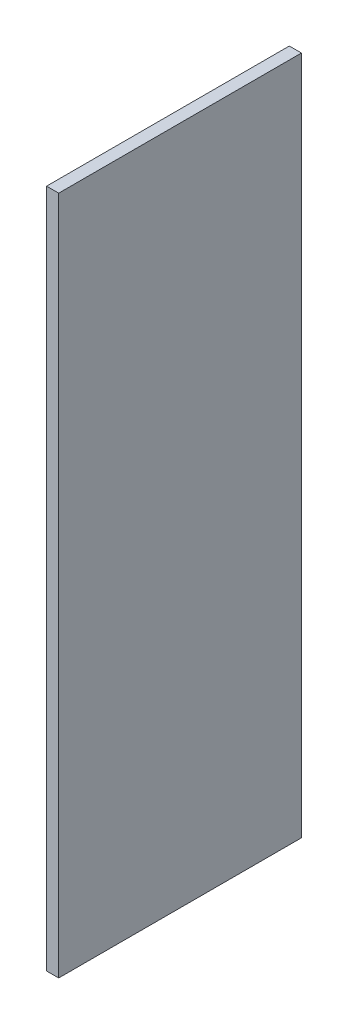
ISO-10303-21;
HEADER;
FILE_DESCRIPTION(('STEP AP214'),'2;1');
FILE_NAME('part.step','',(''),(''),'','','');
FILE_SCHEMA(('AUTOMOTIVE_DESIGN { 1 0 10303 214 1 1 1 1 }'));
ENDSEC;
DATA;
#1=APPLICATION_CONTEXT('core data for automotive mechanical design processes');
#2=APPLICATION_PROTOCOL_DEFINITION('international standard','automotive_design',2000,#1);
#3=PRODUCT_CONTEXT('',#1,'mechanical');
#4=PRODUCT('Part','Part','',(#3));
#5=PRODUCT_RELATED_PRODUCT_CATEGORY('part','',(#4));
#6=PRODUCT_DEFINITION_FORMATION('','',#4);
#7=PRODUCT_DEFINITION_CONTEXT('part definition',#1,'design');
#8=PRODUCT_DEFINITION('design','',#6,#7);
#9=PRODUCT_DEFINITION_SHAPE('','',#8);
#10=(LENGTH_UNIT() NAMED_UNIT(*) SI_UNIT(.MILLI.,.METRE.));
#11=(NAMED_UNIT(*) PLANE_ANGLE_UNIT() SI_UNIT($,.RADIAN.));
#12=(NAMED_UNIT(*) SI_UNIT($,.STERADIAN.) SOLID_ANGLE_UNIT());
#13=UNCERTAINTY_MEASURE_WITH_UNIT(LENGTH_MEASURE(1.E-05),#10,'distance_accuracy_value','');
#14=(GEOMETRIC_REPRESENTATION_CONTEXT(3) GLOBAL_UNCERTAINTY_ASSIGNED_CONTEXT((#13)) GLOBAL_UNIT_ASSIGNED_CONTEXT((#10,
#11,#12)) REPRESENTATION_CONTEXT('',''));
#15=CARTESIAN_POINT('',(0.,0.,0.));
#16=DIRECTION('',(0.,0.,1.));
#17=DIRECTION('',(1.,0.,0.));
#18=AXIS2_PLACEMENT_3D('',#15,#16,#17);
#19=CARTESIAN_POINT('',(36.1234258505699,-0.845666238971541,209.999961853027));
#20=DIRECTION('',(-1.,0.,0.));
#21=DIRECTION('',(0.,-1.,0.));
#22=AXIS2_PLACEMENT_3D('',#19,#20,#21);
#23=PLANE('',#22);
#24=DIRECTION('',(0.,0.,1.));
#25=VECTOR('',#24,1.);
#26=CARTESIAN_POINT('',(36.1234258505698,-28.845666238971,-14.6487852842924));
#27=LINE('',#26,#25);
#28=CARTESIAN_POINT('',(36.1234258505698,-28.845666238971,-14.6487852842923));
#29=VERTEX_POINT('',#28);
#30=CARTESIAN_POINT('',(36.1234258505698,-28.845666238971,5.35121471570826));
#31=VERTEX_POINT('',#30);
#32=EDGE_CURVE('E79',#29,#31,#27,.T.);
#33=ORIENTED_EDGE('',*,*,#32,.F.);
#34=DIRECTION('',(0.,1.,0.));
#35=VECTOR('',#34,1.);
#36=CARTESIAN_POINT('',(36.12342585057,27.1543337610291,-14.6487852842922));
#37=LINE('',#36,#35);
#38=CARTESIAN_POINT('',(36.12342585057,27.154333761029,-14.6487852842922));
#39=VERTEX_POINT('',#38);
#40=EDGE_CURVE('E55',#39,#29,#37,.F.);
#41=ORIENTED_EDGE('',*,*,#40,.F.);
#42=DIRECTION('',(0.,0.,1.));
#43=VECTOR('',#42,1.);
#44=CARTESIAN_POINT('',(36.12342585057,27.154333761029,5.35121471570839));
#45=LINE('',#44,#43);
#46=CARTESIAN_POINT('',(36.12342585057,27.154333761029,5.35121471570833));
#47=VERTEX_POINT('',#46);
#48=EDGE_CURVE('E57',#47,#39,#45,.F.);
#49=ORIENTED_EDGE('',*,*,#48,.F.);
#50=DIRECTION('',(0.,-1.,0.));
#51=VECTOR('',#50,1.);
#52=CARTESIAN_POINT('',(36.1234258505698,-28.845666238971,5.35121471570825));
#53=LINE('',#52,#51);
#54=EDGE_CURVE('E20',#31,#47,#53,.F.);
#55=ORIENTED_EDGE('',*,*,#54,.F.);
#56=EDGE_LOOP('',(#33,#41,#49,#55));
#57=FACE_BOUND('',#56,.T.);
#58=ADVANCED_FACE('F17',(#57),#23,.F.);
#59=CARTESIAN_POINT('',(36.1234258505698,-28.845666238971,5.35121471570825));
#60=DIRECTION('',(0.,0.,1.));
#61=DIRECTION('',(0.,-1.,0.));
#62=AXIS2_PLACEMENT_3D('',#59,#60,#61);
#63=PLANE('',#62);
#64=DIRECTION('',(0.,-1.,0.));
#65=VECTOR('',#64,1.);
#66=CARTESIAN_POINT('',(35.1234258505699,-0.845666238971536,5.35121471570826));
#67=LINE('',#66,#65);
#68=CARTESIAN_POINT('',(35.1234258505699,-28.845666238971,5.35121471570825));
#69=VERTEX_POINT('',#68);
#70=CARTESIAN_POINT('',(35.12342585057,27.154333761029,5.35121471570836));
#71=VERTEX_POINT('',#70);
#72=EDGE_CURVE('E83',#69,#71,#67,.F.);
#73=ORIENTED_EDGE('',*,*,#72,.F.);
#74=DIRECTION('',(1.,0.,0.));
#75=VECTOR('',#74,1.);
#76=CARTESIAN_POINT('',(36.1234258505698,-28.845666238971,5.35121471570825));
#77=LINE('',#76,#75);
#78=EDGE_CURVE('E68',#31,#69,#77,.F.);
#79=ORIENTED_EDGE('',*,*,#78,.F.);
#80=ORIENTED_EDGE('',*,*,#54,.T.);
#81=DIRECTION('',(-1.,0.,0.));
#82=VECTOR('',#81,1.);
#83=CARTESIAN_POINT('',(36.12342585057,27.154333761029,5.35121471570839));
#84=LINE('',#83,#82);
#85=EDGE_CURVE('E63',#71,#47,#84,.F.);
#86=ORIENTED_EDGE('',*,*,#85,.F.);
#87=EDGE_LOOP('',(#73,#79,#80,#86));
#88=FACE_BOUND('',#87,.T.);
#89=ADVANCED_FACE('F65',(#88),#63,.T.);
#90=CARTESIAN_POINT('',(36.12342585057,27.154333761029,5.35121471570839));
#91=DIRECTION('',(0.,1.,0.));
#92=DIRECTION('',(-1.,0.,0.));
#93=AXIS2_PLACEMENT_3D('',#90,#91,#92);
#94=PLANE('',#93);
#95=DIRECTION('',(0.,0.,1.));
#96=VECTOR('',#95,1.);
#97=CARTESIAN_POINT('',(35.12342585057,27.154333761029,209.999961853027));
#98=LINE('',#97,#96);
#99=CARTESIAN_POINT('',(35.12342585057,27.1543337610291,-14.6487852842922));
#100=VERTEX_POINT('',#99);
#101=EDGE_CURVE('E72',#71,#100,#98,.F.);
#102=ORIENTED_EDGE('',*,*,#101,.F.);
#103=ORIENTED_EDGE('',*,*,#85,.T.);
#104=ORIENTED_EDGE('',*,*,#48,.T.);
#105=DIRECTION('',(1.,0.,0.));
#106=VECTOR('',#105,1.);
#107=CARTESIAN_POINT('',(36.12342585057,27.1543337610291,-14.6487852842922));
#108=LINE('',#107,#106);
#109=EDGE_CURVE('E75',#100,#39,#108,.T.);
#110=ORIENTED_EDGE('',*,*,#109,.F.);
#111=EDGE_LOOP('',(#102,#103,#104,#110));
#112=FACE_BOUND('',#111,.T.);
#113=ADVANCED_FACE('F70',(#112),#94,.T.);
#114=CARTESIAN_POINT('',(36.12342585057,27.1543337610291,-14.6487852842922));
#115=DIRECTION('',(0.,0.,-1.));
#116=DIRECTION('',(0.,1.,0.));
#117=AXIS2_PLACEMENT_3D('',#114,#115,#116);
#118=PLANE('',#117);
#119=DIRECTION('',(0.,-1.,0.));
#120=VECTOR('',#119,1.);
#121=CARTESIAN_POINT('',(35.1234258505699,-0.845666238971536,-14.6487852842922));
#122=LINE('',#121,#120);
#123=CARTESIAN_POINT('',(35.1234258505698,-28.845666238971,-14.6487852842923));
#124=VERTEX_POINT('',#123);
#125=EDGE_CURVE('E26',#100,#124,#122,.T.);
#126=ORIENTED_EDGE('',*,*,#125,.F.);
#127=ORIENTED_EDGE('',*,*,#109,.T.);
#128=ORIENTED_EDGE('',*,*,#40,.T.);
#129=DIRECTION('',(1.,0.,0.));
#130=VECTOR('',#129,1.);
#131=CARTESIAN_POINT('',(36.1234258505698,-28.845666238971,-14.6487852842924));
#132=LINE('',#131,#130);
#133=EDGE_CURVE('E35',#124,#29,#132,.T.);
#134=ORIENTED_EDGE('',*,*,#133,.F.);
#135=EDGE_LOOP('',(#126,#127,#128,#134));
#136=FACE_BOUND('',#135,.T.);
#137=ADVANCED_FACE('F89',(#136),#118,.T.);
#138=CARTESIAN_POINT('',(36.1234258505698,-28.845666238971,-14.6487852842924));
#139=DIRECTION('',(0.,-1.,0.));
#140=DIRECTION('',(1.,0.,0.));
#141=AXIS2_PLACEMENT_3D('',#138,#139,#140);
#142=PLANE('',#141);
#143=DIRECTION('',(0.,0.,1.));
#144=VECTOR('',#143,1.);
#145=CARTESIAN_POINT('',(35.1234258505698,-28.845666238971,209.999961853027));
#146=LINE('',#145,#144);
#147=EDGE_CURVE('E11',#124,#69,#146,.T.);
#148=ORIENTED_EDGE('',*,*,#147,.F.);
#149=ORIENTED_EDGE('',*,*,#133,.T.);
#150=ORIENTED_EDGE('',*,*,#32,.T.);
#151=ORIENTED_EDGE('',*,*,#78,.T.);
#152=EDGE_LOOP('',(#148,#149,#150,#151));
#153=FACE_BOUND('',#152,.T.);
#154=ADVANCED_FACE('F91',(#153),#142,.T.);
#155=CARTESIAN_POINT('',(35.1234258505699,-0.845666238971536,209.999961853027));
#156=DIRECTION('',(-1.,0.,0.));
#157=DIRECTION('',(0.,-1.,0.));
#158=AXIS2_PLACEMENT_3D('',#155,#156,#157);
#159=PLANE('',#158);
#160=ORIENTED_EDGE('',*,*,#125,.T.);
#161=ORIENTED_EDGE('',*,*,#147,.T.);
#162=ORIENTED_EDGE('',*,*,#72,.T.);
#163=ORIENTED_EDGE('',*,*,#101,.T.);
#164=EDGE_LOOP('',(#160,#161,#162,#163));
#165=FACE_BOUND('',#164,.T.);
#166=ADVANCED_FACE('F88',(#165),#159,.T.);
#167=CLOSED_SHELL('',(#58,#89,#113,#137,#154,#166));
#168=MANIFOLD_SOLID_BREP('B1',#167);
#169=ADVANCED_BREP_SHAPE_REPRESENTATION('',(#18,#168),#14);
#170=SHAPE_DEFINITION_REPRESENTATION(#9,#169);
ENDSEC;
END-ISO-10303-21;
